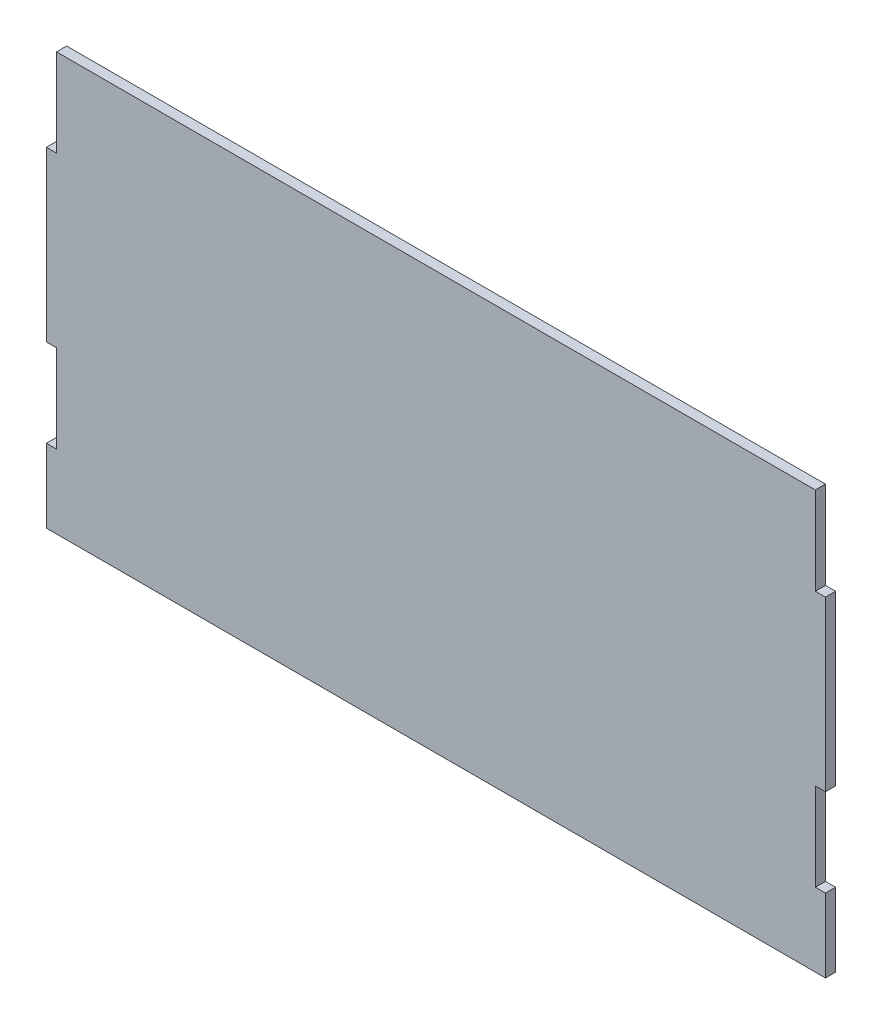
ISO-10303-21;
HEADER;
FILE_DESCRIPTION(('STEP AP214'),'2;1');
FILE_NAME('part.step','',(''),(''),'','','');
FILE_SCHEMA(('AUTOMOTIVE_DESIGN { 1 0 10303 214 1 1 1 1 }'));
ENDSEC;
DATA;
#1=APPLICATION_CONTEXT('core data for automotive mechanical design processes');
#2=APPLICATION_PROTOCOL_DEFINITION('international standard','automotive_design',2000,#1);
#3=PRODUCT_CONTEXT('',#1,'mechanical');
#4=PRODUCT('Part','Part','',(#3));
#5=PRODUCT_RELATED_PRODUCT_CATEGORY('part','',(#4));
#6=PRODUCT_DEFINITION_FORMATION('','',#4);
#7=PRODUCT_DEFINITION_CONTEXT('part definition',#1,'design');
#8=PRODUCT_DEFINITION('design','',#6,#7);
#9=PRODUCT_DEFINITION_SHAPE('','',#8);
#10=(LENGTH_UNIT() NAMED_UNIT(*) SI_UNIT(.MILLI.,.METRE.));
#11=(NAMED_UNIT(*) PLANE_ANGLE_UNIT() SI_UNIT($,.RADIAN.));
#12=(NAMED_UNIT(*) SI_UNIT($,.STERADIAN.) SOLID_ANGLE_UNIT());
#13=UNCERTAINTY_MEASURE_WITH_UNIT(LENGTH_MEASURE(1.E-05),#10,'distance_accuracy_value','');
#14=(GEOMETRIC_REPRESENTATION_CONTEXT(3) GLOBAL_UNCERTAINTY_ASSIGNED_CONTEXT((#13)) GLOBAL_UNIT_ASSIGNED_CONTEXT((#10,
#11,#12)) REPRESENTATION_CONTEXT('',''));
#15=CARTESIAN_POINT('',(0.,0.,0.));
#16=DIRECTION('',(0.,0.,1.));
#17=DIRECTION('',(1.,0.,0.));
#18=AXIS2_PLACEMENT_3D('',#15,#16,#17);
#19=CARTESIAN_POINT('',(112.657319819799,49.5841216216235,3.));
#20=DIRECTION('',(0.,-1.,0.));
#21=DIRECTION('',(1.,0.,0.));
#22=AXIS2_PLACEMENT_3D('',#19,#20,#21);
#23=PLANE('',#22);
#24=DIRECTION('',(-1.,0.,0.));
#25=VECTOR('',#24,1.);
#26=CARTESIAN_POINT('',(112.657319819799,49.5841216216235,0.));
#27=LINE('',#26,#25);
#28=CARTESIAN_POINT('',(112.657319819799,49.5841216216235,0.));
#29=VERTEX_POINT('',#28);
#30=CARTESIAN_POINT('',(-112.342680180183,49.5841216216235,0.));
#31=VERTEX_POINT('',#30);
#32=EDGE_CURVE('E180',#29,#31,#27,.T.);
#33=ORIENTED_EDGE('',*,*,#32,.T.);
#34=DIRECTION('',(0.,0.,-1.));
#35=VECTOR('',#34,1.);
#36=CARTESIAN_POINT('',(-112.342680180183,49.5841216216235,3.));
#37=LINE('',#36,#35);
#38=CARTESIAN_POINT('',(-112.342680180183,49.5841216216235,3.));
#39=VERTEX_POINT('',#38);
#40=EDGE_CURVE('E11',#39,#31,#37,.T.);
#41=ORIENTED_EDGE('',*,*,#40,.F.);
#42=DIRECTION('',(-1.,0.,0.));
#43=VECTOR('',#42,1.);
#44=CARTESIAN_POINT('',(112.657319819799,49.5841216216235,3.));
#45=LINE('',#44,#43);
#46=CARTESIAN_POINT('',(112.657319819799,49.5841216216235,3.));
#47=VERTEX_POINT('',#46);
#48=EDGE_CURVE('E210',#47,#39,#45,.T.);
#49=ORIENTED_EDGE('',*,*,#48,.F.);
#50=DIRECTION('',(0.,0.,-1.));
#51=VECTOR('',#50,1.);
#52=CARTESIAN_POINT('',(112.657319819799,49.5841216216235,3.));
#53=LINE('',#52,#51);
#54=EDGE_CURVE('E176',#47,#29,#53,.T.);
#55=ORIENTED_EDGE('',*,*,#54,.T.);
#56=EDGE_LOOP('',(#33,#41,#49,#55));
#57=FACE_BOUND('',#56,.T.);
#58=ADVANCED_FACE('F36',(#57),#23,.F.);
#59=CARTESIAN_POINT('',(-112.342680180183,49.5841216216235,3.));
#60=DIRECTION('',(1.,0.,0.));
#61=DIRECTION('',(0.,0.,-1.));
#62=AXIS2_PLACEMENT_3D('',#59,#60,#61);
#63=PLANE('',#62);
#64=DIRECTION('',(0.,-1.,0.));
#65=VECTOR('',#64,1.);
#66=CARTESIAN_POINT('',(-112.342680180183,49.5841216216235,0.));
#67=LINE('',#66,#65);
#68=CARTESIAN_POINT('',(-112.342680180183,23.5841216216234,0.));
#69=VERTEX_POINT('',#68);
#70=EDGE_CURVE('E183',#31,#69,#67,.T.);
#71=ORIENTED_EDGE('',*,*,#70,.T.);
#72=DIRECTION('',(0.,0.,-1.));
#73=VECTOR('',#72,1.);
#74=CARTESIAN_POINT('',(-112.342680180183,23.5841216216234,3.));
#75=LINE('',#74,#73);
#76=CARTESIAN_POINT('',(-112.342680180183,23.5841216216234,3.));
#77=VERTEX_POINT('',#76);
#78=EDGE_CURVE('E44',#77,#69,#75,.T.);
#79=ORIENTED_EDGE('',*,*,#78,.F.);
#80=DIRECTION('',(0.,-1.,0.));
#81=VECTOR('',#80,1.);
#82=CARTESIAN_POINT('',(-112.342680180183,49.5841216216235,3.));
#83=LINE('',#82,#81);
#84=EDGE_CURVE('E119',#39,#77,#83,.T.);
#85=ORIENTED_EDGE('',*,*,#84,.F.);
#86=ORIENTED_EDGE('',*,*,#40,.T.);
#87=EDGE_LOOP('',(#71,#79,#85,#86));
#88=FACE_BOUND('',#87,.T.);
#89=ADVANCED_FACE('F308',(#88),#63,.F.);
#90=CARTESIAN_POINT('',(-112.342680180183,23.5841216216234,3.));
#91=DIRECTION('',(0.,-1.,0.));
#92=DIRECTION('',(1.,0.,0.));
#93=AXIS2_PLACEMENT_3D('',#90,#91,#92);
#94=PLANE('',#93);
#95=DIRECTION('',(-1.,0.,0.));
#96=VECTOR('',#95,1.);
#97=CARTESIAN_POINT('',(-112.342680180183,23.5841216216234,0.));
#98=LINE('',#97,#96);
#99=CARTESIAN_POINT('',(-115.342680180183,23.5841216216234,0.));
#100=VERTEX_POINT('',#99);
#101=EDGE_CURVE('E185',#69,#100,#98,.T.);
#102=ORIENTED_EDGE('',*,*,#101,.T.);
#103=DIRECTION('',(0.,0.,-1.));
#104=VECTOR('',#103,1.);
#105=CARTESIAN_POINT('',(-115.342680180183,23.5841216216234,3.));
#106=LINE('',#105,#104);
#107=CARTESIAN_POINT('',(-115.342680180183,23.5841216216234,3.));
#108=VERTEX_POINT('',#107);
#109=EDGE_CURVE('E241',#108,#100,#106,.T.);
#110=ORIENTED_EDGE('',*,*,#109,.F.);
#111=DIRECTION('',(-1.,0.,0.));
#112=VECTOR('',#111,1.);
#113=CARTESIAN_POINT('',(-112.342680180183,23.5841216216234,3.));
#114=LINE('',#113,#112);
#115=EDGE_CURVE('E249',#77,#108,#114,.T.);
#116=ORIENTED_EDGE('',*,*,#115,.F.);
#117=ORIENTED_EDGE('',*,*,#78,.T.);
#118=EDGE_LOOP('',(#102,#110,#116,#117));
#119=FACE_BOUND('',#118,.T.);
#120=ADVANCED_FACE('F247',(#119),#94,.F.);
#121=CARTESIAN_POINT('',(-115.342680180183,23.5841216216234,3.));
#122=DIRECTION('',(1.,0.,0.));
#123=DIRECTION('',(0.,0.,-1.));
#124=AXIS2_PLACEMENT_3D('',#121,#122,#123);
#125=PLANE('',#124);
#126=DIRECTION('',(0.,-1.,0.));
#127=VECTOR('',#126,1.);
#128=CARTESIAN_POINT('',(-115.342680180183,23.5841216216234,0.));
#129=LINE('',#128,#127);
#130=CARTESIAN_POINT('',(-115.342680180183,-26.4158783783766,0.));
#131=VERTEX_POINT('',#130);
#132=EDGE_CURVE('E187',#100,#131,#129,.T.);
#133=ORIENTED_EDGE('',*,*,#132,.T.);
#134=DIRECTION('',(0.,0.,-1.));
#135=VECTOR('',#134,1.);
#136=CARTESIAN_POINT('',(-115.342680180183,-26.4158783783766,3.));
#137=LINE('',#136,#135);
#138=CARTESIAN_POINT('',(-115.342680180183,-26.4158783783766,3.));
#139=VERTEX_POINT('',#138);
#140=EDGE_CURVE('E238',#139,#131,#137,.T.);
#141=ORIENTED_EDGE('',*,*,#140,.F.);
#142=DIRECTION('',(0.,-1.,0.));
#143=VECTOR('',#142,1.);
#144=CARTESIAN_POINT('',(-115.342680180183,23.5841216216234,3.));
#145=LINE('',#144,#143);
#146=EDGE_CURVE('E267',#108,#139,#145,.T.);
#147=ORIENTED_EDGE('',*,*,#146,.F.);
#148=ORIENTED_EDGE('',*,*,#109,.T.);
#149=EDGE_LOOP('',(#133,#141,#147,#148));
#150=FACE_BOUND('',#149,.T.);
#151=ADVANCED_FACE('F258',(#150),#125,.F.);
#152=CARTESIAN_POINT('',(-115.342680180183,-26.4158783783766,3.));
#153=DIRECTION('',(0.,1.,0.));
#154=DIRECTION('',(-1.,0.,0.));
#155=AXIS2_PLACEMENT_3D('',#152,#153,#154);
#156=PLANE('',#155);
#157=DIRECTION('',(1.,0.,0.));
#158=VECTOR('',#157,1.);
#159=CARTESIAN_POINT('',(-115.342680180183,-26.4158783783766,0.));
#160=LINE('',#159,#158);
#161=CARTESIAN_POINT('',(-112.342680180183,-26.4158783783766,0.));
#162=VERTEX_POINT('',#161);
#163=EDGE_CURVE('E189',#131,#162,#160,.T.);
#164=ORIENTED_EDGE('',*,*,#163,.T.);
#165=DIRECTION('',(0.,0.,-1.));
#166=VECTOR('',#165,1.);
#167=CARTESIAN_POINT('',(-112.342680180183,-26.4158783783766,3.));
#168=LINE('',#167,#166);
#169=CARTESIAN_POINT('',(-112.342680180183,-26.4158783783766,3.));
#170=VERTEX_POINT('',#169);
#171=EDGE_CURVE('E235',#170,#162,#168,.T.);
#172=ORIENTED_EDGE('',*,*,#171,.F.);
#173=DIRECTION('',(1.,0.,0.));
#174=VECTOR('',#173,1.);
#175=CARTESIAN_POINT('',(-115.342680180183,-26.4158783783766,3.));
#176=LINE('',#175,#174);
#177=EDGE_CURVE('E264',#139,#170,#176,.T.);
#178=ORIENTED_EDGE('',*,*,#177,.F.);
#179=ORIENTED_EDGE('',*,*,#140,.T.);
#180=EDGE_LOOP('',(#164,#172,#178,#179));
#181=FACE_BOUND('',#180,.T.);
#182=ADVANCED_FACE('F262',(#181),#156,.F.);
#183=CARTESIAN_POINT('',(-112.342680180183,-26.4158783783766,3.));
#184=DIRECTION('',(1.,0.,0.));
#185=DIRECTION('',(0.,1.,0.));
#186=AXIS2_PLACEMENT_3D('',#183,#184,#185);
#187=PLANE('',#186);
#188=DIRECTION('',(0.,-1.,0.));
#189=VECTOR('',#188,1.);
#190=CARTESIAN_POINT('',(-112.342680180183,-26.4158783783766,0.));
#191=LINE('',#190,#189);
#192=CARTESIAN_POINT('',(-112.342680180183,-52.4158783783766,0.));
#193=VERTEX_POINT('',#192);
#194=EDGE_CURVE('E191',#162,#193,#191,.T.);
#195=ORIENTED_EDGE('',*,*,#194,.T.);
#196=DIRECTION('',(0.,0.,-1.));
#197=VECTOR('',#196,1.);
#198=CARTESIAN_POINT('',(-112.342680180183,-52.4158783783766,3.));
#199=LINE('',#198,#197);
#200=CARTESIAN_POINT('',(-112.342680180183,-52.4158783783766,3.));
#201=VERTEX_POINT('',#200);
#202=EDGE_CURVE('E232',#201,#193,#199,.T.);
#203=ORIENTED_EDGE('',*,*,#202,.F.);
#204=DIRECTION('',(0.,-1.,0.));
#205=VECTOR('',#204,1.);
#206=CARTESIAN_POINT('',(-112.342680180183,-26.4158783783766,3.));
#207=LINE('',#206,#205);
#208=EDGE_CURVE('E266',#170,#201,#207,.T.);
#209=ORIENTED_EDGE('',*,*,#208,.F.);
#210=ORIENTED_EDGE('',*,*,#171,.T.);
#211=EDGE_LOOP('',(#195,#203,#209,#210));
#212=FACE_BOUND('',#211,.T.);
#213=ADVANCED_FACE('F321',(#212),#187,.F.);
#214=CARTESIAN_POINT('',(-112.342680180183,-52.4158783783766,3.));
#215=DIRECTION('',(0.,-1.,0.));
#216=DIRECTION('',(0.,0.,-1.));
#217=AXIS2_PLACEMENT_3D('',#214,#215,#216);
#218=PLANE('',#217);
#219=DIRECTION('',(-1.,0.,0.));
#220=VECTOR('',#219,1.);
#221=CARTESIAN_POINT('',(-112.342680180183,-52.4158783783766,0.));
#222=LINE('',#221,#220);
#223=CARTESIAN_POINT('',(-115.342680180183,-52.4158783783766,0.));
#224=VERTEX_POINT('',#223);
#225=EDGE_CURVE('E193',#193,#224,#222,.T.);
#226=ORIENTED_EDGE('',*,*,#225,.T.);
#227=DIRECTION('',(0.,0.,-1.));
#228=VECTOR('',#227,1.);
#229=CARTESIAN_POINT('',(-115.342680180183,-52.4158783783766,3.));
#230=LINE('',#229,#228);
#231=CARTESIAN_POINT('',(-115.342680180183,-52.4158783783766,3.));
#232=VERTEX_POINT('',#231);
#233=EDGE_CURVE('E229',#232,#224,#230,.T.);
#234=ORIENTED_EDGE('',*,*,#233,.F.);
#235=DIRECTION('',(-1.,0.,0.));
#236=VECTOR('',#235,1.);
#237=CARTESIAN_POINT('',(-112.342680180183,-52.4158783783766,3.));
#238=LINE('',#237,#236);
#239=EDGE_CURVE('E269',#201,#232,#238,.T.);
#240=ORIENTED_EDGE('',*,*,#239,.F.);
#241=ORIENTED_EDGE('',*,*,#202,.T.);
#242=EDGE_LOOP('',(#226,#234,#240,#241));
#243=FACE_BOUND('',#242,.T.);
#244=ADVANCED_FACE('F324',(#243),#218,.F.);
#245=CARTESIAN_POINT('',(-115.342680180183,-52.4158783783766,3.));
#246=DIRECTION('',(1.,0.,0.));
#247=DIRECTION('',(0.,0.,-1.));
#248=AXIS2_PLACEMENT_3D('',#245,#246,#247);
#249=PLANE('',#248);
#250=DIRECTION('',(0.,-1.,0.));
#251=VECTOR('',#250,1.);
#252=CARTESIAN_POINT('',(-115.342680180183,-52.4158783783766,0.));
#253=LINE('',#252,#251);
#254=CARTESIAN_POINT('',(-115.342680180183,-74.2258783783766,0.));
#255=VERTEX_POINT('',#254);
#256=EDGE_CURVE('E195',#224,#255,#253,.T.);
#257=ORIENTED_EDGE('',*,*,#256,.T.);
#258=DIRECTION('',(0.,0.,-1.));
#259=VECTOR('',#258,1.);
#260=CARTESIAN_POINT('',(-115.342680180183,-74.2258783783766,3.));
#261=LINE('',#260,#259);
#262=CARTESIAN_POINT('',(-115.342680180183,-74.2258783783766,3.));
#263=VERTEX_POINT('',#262);
#264=EDGE_CURVE('E226',#263,#255,#261,.T.);
#265=ORIENTED_EDGE('',*,*,#264,.F.);
#266=DIRECTION('',(0.,-1.,0.));
#267=VECTOR('',#266,1.);
#268=CARTESIAN_POINT('',(-115.342680180183,-52.4158783783766,3.));
#269=LINE('',#268,#267);
#270=EDGE_CURVE('E275',#232,#263,#269,.T.);
#271=ORIENTED_EDGE('',*,*,#270,.F.);
#272=ORIENTED_EDGE('',*,*,#233,.T.);
#273=EDGE_LOOP('',(#257,#265,#271,#272));
#274=FACE_BOUND('',#273,.T.);
#275=ADVANCED_FACE('F328',(#274),#249,.F.);
#276=CARTESIAN_POINT('',(-115.342680180183,-74.2258783783766,3.));
#277=DIRECTION('',(0.,1.,0.));
#278=DIRECTION('',(0.,0.,1.));
#279=AXIS2_PLACEMENT_3D('',#276,#277,#278);
#280=PLANE('',#279);
#281=DIRECTION('',(1.,0.,0.));
#282=VECTOR('',#281,1.);
#283=CARTESIAN_POINT('',(-115.342680180183,-74.2258783783766,0.));
#284=LINE('',#283,#282);
#285=CARTESIAN_POINT('',(115.657319819799,-74.2258783783766,0.));
#286=VERTEX_POINT('',#285);
#287=EDGE_CURVE('E197',#255,#286,#284,.T.);
#288=ORIENTED_EDGE('',*,*,#287,.T.);
#289=DIRECTION('',(0.,0.,-1.));
#290=VECTOR('',#289,1.);
#291=CARTESIAN_POINT('',(115.657319819799,-74.2258783783766,3.));
#292=LINE('',#291,#290);
#293=CARTESIAN_POINT('',(115.657319819799,-74.2258783783766,3.));
#294=VERTEX_POINT('',#293);
#295=EDGE_CURVE('E223',#294,#286,#292,.T.);
#296=ORIENTED_EDGE('',*,*,#295,.F.);
#297=DIRECTION('',(1.,0.,0.));
#298=VECTOR('',#297,1.);
#299=CARTESIAN_POINT('',(-115.342680180183,-74.2258783783766,3.));
#300=LINE('',#299,#298);
#301=EDGE_CURVE('E277',#263,#294,#300,.T.);
#302=ORIENTED_EDGE('',*,*,#301,.F.);
#303=ORIENTED_EDGE('',*,*,#264,.T.);
#304=EDGE_LOOP('',(#288,#296,#302,#303));
#305=FACE_BOUND('',#304,.T.);
#306=ADVANCED_FACE('F332',(#305),#280,.F.);
#307=CARTESIAN_POINT('',(115.657319819799,-74.2258783783766,3.));
#308=DIRECTION('',(-1.,0.,0.));
#309=DIRECTION('',(0.,-1.,0.));
#310=AXIS2_PLACEMENT_3D('',#307,#308,#309);
#311=PLANE('',#310);
#312=DIRECTION('',(0.,1.,0.));
#313=VECTOR('',#312,1.);
#314=CARTESIAN_POINT('',(115.657319819799,-74.2258783783766,0.));
#315=LINE('',#314,#313);
#316=CARTESIAN_POINT('',(115.657319819799,-52.4158783783766,0.));
#317=VERTEX_POINT('',#316);
#318=EDGE_CURVE('E199',#286,#317,#315,.T.);
#319=ORIENTED_EDGE('',*,*,#318,.T.);
#320=DIRECTION('',(0.,0.,-1.));
#321=VECTOR('',#320,1.);
#322=CARTESIAN_POINT('',(115.657319819799,-52.4158783783766,3.));
#323=LINE('',#322,#321);
#324=CARTESIAN_POINT('',(115.657319819799,-52.4158783783766,3.));
#325=VERTEX_POINT('',#324);
#326=EDGE_CURVE('E220',#325,#317,#323,.T.);
#327=ORIENTED_EDGE('',*,*,#326,.F.);
#328=DIRECTION('',(0.,1.,0.));
#329=VECTOR('',#328,1.);
#330=CARTESIAN_POINT('',(115.657319819799,-74.2258783783766,3.));
#331=LINE('',#330,#329);
#332=EDGE_CURVE('E279',#294,#325,#331,.T.);
#333=ORIENTED_EDGE('',*,*,#332,.F.);
#334=ORIENTED_EDGE('',*,*,#295,.T.);
#335=EDGE_LOOP('',(#319,#327,#333,#334));
#336=FACE_BOUND('',#335,.T.);
#337=ADVANCED_FACE('F336',(#336),#311,.F.);
#338=CARTESIAN_POINT('',(115.657319819799,-52.4158783783766,3.));
#339=DIRECTION('',(0.,-1.,0.));
#340=DIRECTION('',(0.,0.,-1.));
#341=AXIS2_PLACEMENT_3D('',#338,#339,#340);
#342=PLANE('',#341);
#343=DIRECTION('',(-1.,0.,0.));
#344=VECTOR('',#343,1.);
#345=CARTESIAN_POINT('',(115.657319819799,-52.4158783783766,0.));
#346=LINE('',#345,#344);
#347=CARTESIAN_POINT('',(112.657319819799,-52.4158783783766,0.));
#348=VERTEX_POINT('',#347);
#349=EDGE_CURVE('E201',#317,#348,#346,.T.);
#350=ORIENTED_EDGE('',*,*,#349,.T.);
#351=DIRECTION('',(0.,0.,-1.));
#352=VECTOR('',#351,1.);
#353=CARTESIAN_POINT('',(112.657319819799,-52.4158783783766,3.));
#354=LINE('',#353,#352);
#355=CARTESIAN_POINT('',(112.657319819799,-52.4158783783766,3.));
#356=VERTEX_POINT('',#355);
#357=EDGE_CURVE('E217',#356,#348,#354,.T.);
#358=ORIENTED_EDGE('',*,*,#357,.F.);
#359=DIRECTION('',(-1.,0.,0.));
#360=VECTOR('',#359,1.);
#361=CARTESIAN_POINT('',(115.657319819799,-52.4158783783766,3.));
#362=LINE('',#361,#360);
#363=EDGE_CURVE('E281',#325,#356,#362,.T.);
#364=ORIENTED_EDGE('',*,*,#363,.F.);
#365=ORIENTED_EDGE('',*,*,#326,.T.);
#366=EDGE_LOOP('',(#350,#358,#364,#365));
#367=FACE_BOUND('',#366,.T.);
#368=ADVANCED_FACE('F340',(#367),#342,.F.);
#369=CARTESIAN_POINT('',(112.657319819799,-52.4158783783766,3.));
#370=DIRECTION('',(-1.,0.,0.));
#371=DIRECTION('',(0.,0.,1.));
#372=AXIS2_PLACEMENT_3D('',#369,#370,#371);
#373=PLANE('',#372);
#374=DIRECTION('',(0.,1.,0.));
#375=VECTOR('',#374,1.);
#376=CARTESIAN_POINT('',(112.657319819799,-52.4158783783766,0.));
#377=LINE('',#376,#375);
#378=CARTESIAN_POINT('',(112.657319819799,-26.4158783783766,0.));
#379=VERTEX_POINT('',#378);
#380=EDGE_CURVE('E203',#348,#379,#377,.T.);
#381=ORIENTED_EDGE('',*,*,#380,.T.);
#382=DIRECTION('',(0.,0.,-1.));
#383=VECTOR('',#382,1.);
#384=CARTESIAN_POINT('',(112.657319819799,-26.4158783783766,3.));
#385=LINE('',#384,#383);
#386=CARTESIAN_POINT('',(112.657319819799,-26.4158783783766,3.));
#387=VERTEX_POINT('',#386);
#388=EDGE_CURVE('E214',#387,#379,#385,.T.);
#389=ORIENTED_EDGE('',*,*,#388,.F.);
#390=DIRECTION('',(0.,1.,0.));
#391=VECTOR('',#390,1.);
#392=CARTESIAN_POINT('',(112.657319819799,-52.4158783783766,3.));
#393=LINE('',#392,#391);
#394=EDGE_CURVE('E283',#356,#387,#393,.T.);
#395=ORIENTED_EDGE('',*,*,#394,.F.);
#396=ORIENTED_EDGE('',*,*,#357,.T.);
#397=EDGE_LOOP('',(#381,#389,#395,#396));
#398=FACE_BOUND('',#397,.T.);
#399=ADVANCED_FACE('F289',(#398),#373,.F.);
#400=CARTESIAN_POINT('',(112.657319819799,-26.4158783783766,3.));
#401=DIRECTION('',(0.,1.,0.));
#402=DIRECTION('',(-1.,0.,0.));
#403=AXIS2_PLACEMENT_3D('',#400,#401,#402);
#404=PLANE('',#403);
#405=DIRECTION('',(1.,0.,0.));
#406=VECTOR('',#405,1.);
#407=CARTESIAN_POINT('',(112.657319819799,-26.4158783783766,0.));
#408=LINE('',#407,#406);
#409=CARTESIAN_POINT('',(115.657319819799,-26.4158783783766,0.));
#410=VERTEX_POINT('',#409);
#411=EDGE_CURVE('E205',#379,#410,#408,.T.);
#412=ORIENTED_EDGE('',*,*,#411,.T.);
#413=DIRECTION('',(0.,0.,-1.));
#414=VECTOR('',#413,1.);
#415=CARTESIAN_POINT('',(115.657319819799,-26.4158783783766,3.));
#416=LINE('',#415,#414);
#417=CARTESIAN_POINT('',(115.657319819799,-26.4158783783766,3.));
#418=VERTEX_POINT('',#417);
#419=EDGE_CURVE('E171',#418,#410,#416,.T.);
#420=ORIENTED_EDGE('',*,*,#419,.F.);
#421=DIRECTION('',(1.,0.,0.));
#422=VECTOR('',#421,1.);
#423=CARTESIAN_POINT('',(112.657319819799,-26.4158783783766,3.));
#424=LINE('',#423,#422);
#425=EDGE_CURVE('E162',#387,#418,#424,.T.);
#426=ORIENTED_EDGE('',*,*,#425,.F.);
#427=ORIENTED_EDGE('',*,*,#388,.T.);
#428=EDGE_LOOP('',(#412,#420,#426,#427));
#429=FACE_BOUND('',#428,.T.);
#430=ADVANCED_FACE('F293',(#429),#404,.F.);
#431=CARTESIAN_POINT('',(115.657319819799,-26.4158783783766,3.));
#432=DIRECTION('',(-1.,0.,0.));
#433=DIRECTION('',(0.,0.,1.));
#434=AXIS2_PLACEMENT_3D('',#431,#432,#433);
#435=PLANE('',#434);
#436=DIRECTION('',(0.,1.,0.));
#437=VECTOR('',#436,1.);
#438=CARTESIAN_POINT('',(115.657319819799,-26.4158783783766,0.));
#439=LINE('',#438,#437);
#440=CARTESIAN_POINT('',(115.657319819799,23.5841216216234,0.));
#441=VERTEX_POINT('',#440);
#442=EDGE_CURVE('E170',#410,#441,#439,.T.);
#443=ORIENTED_EDGE('',*,*,#442,.T.);
#444=DIRECTION('',(0.,0.,-1.));
#445=VECTOR('',#444,1.);
#446=CARTESIAN_POINT('',(115.657319819799,23.5841216216234,3.));
#447=LINE('',#446,#445);
#448=CARTESIAN_POINT('',(115.657319819799,23.5841216216234,3.));
#449=VERTEX_POINT('',#448);
#450=EDGE_CURVE('E167',#449,#441,#447,.T.);
#451=ORIENTED_EDGE('',*,*,#450,.F.);
#452=DIRECTION('',(0.,1.,0.));
#453=VECTOR('',#452,1.);
#454=CARTESIAN_POINT('',(115.657319819799,-26.4158783783766,3.));
#455=LINE('',#454,#453);
#456=EDGE_CURVE('E156',#418,#449,#455,.T.);
#457=ORIENTED_EDGE('',*,*,#456,.F.);
#458=ORIENTED_EDGE('',*,*,#419,.T.);
#459=EDGE_LOOP('',(#443,#451,#457,#458));
#460=FACE_BOUND('',#459,.T.);
#461=ADVANCED_FACE('F168',(#460),#435,.F.);
#462=CARTESIAN_POINT('',(115.657319819799,23.5841216216234,3.));
#463=DIRECTION('',(0.,-1.,0.));
#464=DIRECTION('',(1.,0.,0.));
#465=AXIS2_PLACEMENT_3D('',#462,#463,#464);
#466=PLANE('',#465);
#467=DIRECTION('',(-1.,0.,0.));
#468=VECTOR('',#467,1.);
#469=CARTESIAN_POINT('',(115.657319819799,23.5841216216234,0.));
#470=LINE('',#469,#468);
#471=CARTESIAN_POINT('',(112.657319819799,23.5841216216234,0.));
#472=VERTEX_POINT('',#471);
#473=EDGE_CURVE('E105',#441,#472,#470,.T.);
#474=ORIENTED_EDGE('',*,*,#473,.T.);
#475=DIRECTION('',(0.,0.,-1.));
#476=VECTOR('',#475,1.);
#477=CARTESIAN_POINT('',(112.657319819799,23.5841216216234,3.));
#478=LINE('',#477,#476);
#479=CARTESIAN_POINT('',(112.657319819799,23.5841216216234,3.));
#480=VERTEX_POINT('',#479);
#481=EDGE_CURVE('E172',#480,#472,#478,.T.);
#482=ORIENTED_EDGE('',*,*,#481,.F.);
#483=DIRECTION('',(-1.,0.,0.));
#484=VECTOR('',#483,1.);
#485=CARTESIAN_POINT('',(115.657319819799,23.5841216216234,3.));
#486=LINE('',#485,#484);
#487=EDGE_CURVE('E160',#449,#480,#486,.T.);
#488=ORIENTED_EDGE('',*,*,#487,.F.);
#489=ORIENTED_EDGE('',*,*,#450,.T.);
#490=EDGE_LOOP('',(#474,#482,#488,#489));
#491=FACE_BOUND('',#490,.T.);
#492=ADVANCED_FACE('F174',(#491),#466,.F.);
#493=CARTESIAN_POINT('',(112.657319819799,23.5841216216234,3.));
#494=DIRECTION('',(-1.,0.,0.));
#495=DIRECTION('',(0.,0.,1.));
#496=AXIS2_PLACEMENT_3D('',#493,#494,#495);
#497=PLANE('',#496);
#498=DIRECTION('',(0.,1.,0.));
#499=VECTOR('',#498,1.);
#500=CARTESIAN_POINT('',(112.657319819799,23.5841216216234,0.));
#501=LINE('',#500,#499);
#502=EDGE_CURVE('E111',#472,#29,#501,.T.);
#503=ORIENTED_EDGE('',*,*,#502,.T.);
#504=ORIENTED_EDGE('',*,*,#54,.F.);
#505=DIRECTION('',(0.,1.,0.));
#506=VECTOR('',#505,1.);
#507=CARTESIAN_POINT('',(112.657319819799,23.5841216216234,3.));
#508=LINE('',#507,#506);
#509=EDGE_CURVE('E52',#480,#47,#508,.T.);
#510=ORIENTED_EDGE('',*,*,#509,.F.);
#511=ORIENTED_EDGE('',*,*,#481,.T.);
#512=EDGE_LOOP('',(#503,#504,#510,#511));
#513=FACE_BOUND('',#512,.T.);
#514=ADVANCED_FACE('F297',(#513),#497,.F.);
#515=CARTESIAN_POINT('',(0.,0.,3.));
#516=DIRECTION('',(0.,0.,1.));
#517=DIRECTION('',(1.,0.,0.));
#518=AXIS2_PLACEMENT_3D('',#515,#516,#517);
#519=PLANE('',#518);
#520=ORIENTED_EDGE('',*,*,#48,.T.);
#521=ORIENTED_EDGE('',*,*,#84,.T.);
#522=ORIENTED_EDGE('',*,*,#115,.T.);
#523=ORIENTED_EDGE('',*,*,#146,.T.);
#524=ORIENTED_EDGE('',*,*,#177,.T.);
#525=ORIENTED_EDGE('',*,*,#208,.T.);
#526=ORIENTED_EDGE('',*,*,#239,.T.);
#527=ORIENTED_EDGE('',*,*,#270,.T.);
#528=ORIENTED_EDGE('',*,*,#301,.T.);
#529=ORIENTED_EDGE('',*,*,#332,.T.);
#530=ORIENTED_EDGE('',*,*,#363,.T.);
#531=ORIENTED_EDGE('',*,*,#394,.T.);
#532=ORIENTED_EDGE('',*,*,#425,.T.);
#533=ORIENTED_EDGE('',*,*,#456,.T.);
#534=ORIENTED_EDGE('',*,*,#487,.T.);
#535=ORIENTED_EDGE('',*,*,#509,.T.);
#536=EDGE_LOOP('',(#520,#521,#522,#523,#524,#525,#526,#527,#528,#529,#530,#531,#532,#533,#534,#535));
#537=FACE_BOUND('',#536,.T.);
#538=ADVANCED_FACE('F158',(#537),#519,.T.);
#539=CARTESIAN_POINT('',(0.,0.,0.));
#540=DIRECTION('',(0.,0.,1.));
#541=DIRECTION('',(1.,0.,0.));
#542=AXIS2_PLACEMENT_3D('',#539,#540,#541);
#543=PLANE('',#542);
#544=ORIENTED_EDGE('',*,*,#32,.F.);
#545=ORIENTED_EDGE('',*,*,#502,.F.);
#546=ORIENTED_EDGE('',*,*,#473,.F.);
#547=ORIENTED_EDGE('',*,*,#442,.F.);
#548=ORIENTED_EDGE('',*,*,#411,.F.);
#549=ORIENTED_EDGE('',*,*,#380,.F.);
#550=ORIENTED_EDGE('',*,*,#349,.F.);
#551=ORIENTED_EDGE('',*,*,#318,.F.);
#552=ORIENTED_EDGE('',*,*,#287,.F.);
#553=ORIENTED_EDGE('',*,*,#256,.F.);
#554=ORIENTED_EDGE('',*,*,#225,.F.);
#555=ORIENTED_EDGE('',*,*,#194,.F.);
#556=ORIENTED_EDGE('',*,*,#163,.F.);
#557=ORIENTED_EDGE('',*,*,#132,.F.);
#558=ORIENTED_EDGE('',*,*,#101,.F.);
#559=ORIENTED_EDGE('',*,*,#70,.F.);
#560=EDGE_LOOP('',(#544,#545,#546,#547,#548,#549,#550,#551,#552,#553,#554,#555,#556,#557,#558,#559));
#561=FACE_BOUND('',#560,.T.);
#562=ADVANCED_FACE('F253',(#561),#543,.F.);
#563=CLOSED_SHELL('',(#58,#89,#120,#151,#182,#213,#244,#275,#306,#337,#368,#399,#430,#461,#492,
#514,#538,#562));
#564=MANIFOLD_SOLID_BREP('B2',#563);
#565=ADVANCED_BREP_SHAPE_REPRESENTATION('',(#18,#564),#14);
#566=SHAPE_DEFINITION_REPRESENTATION(#9,#565);
ENDSEC;
END-ISO-10303-21;
